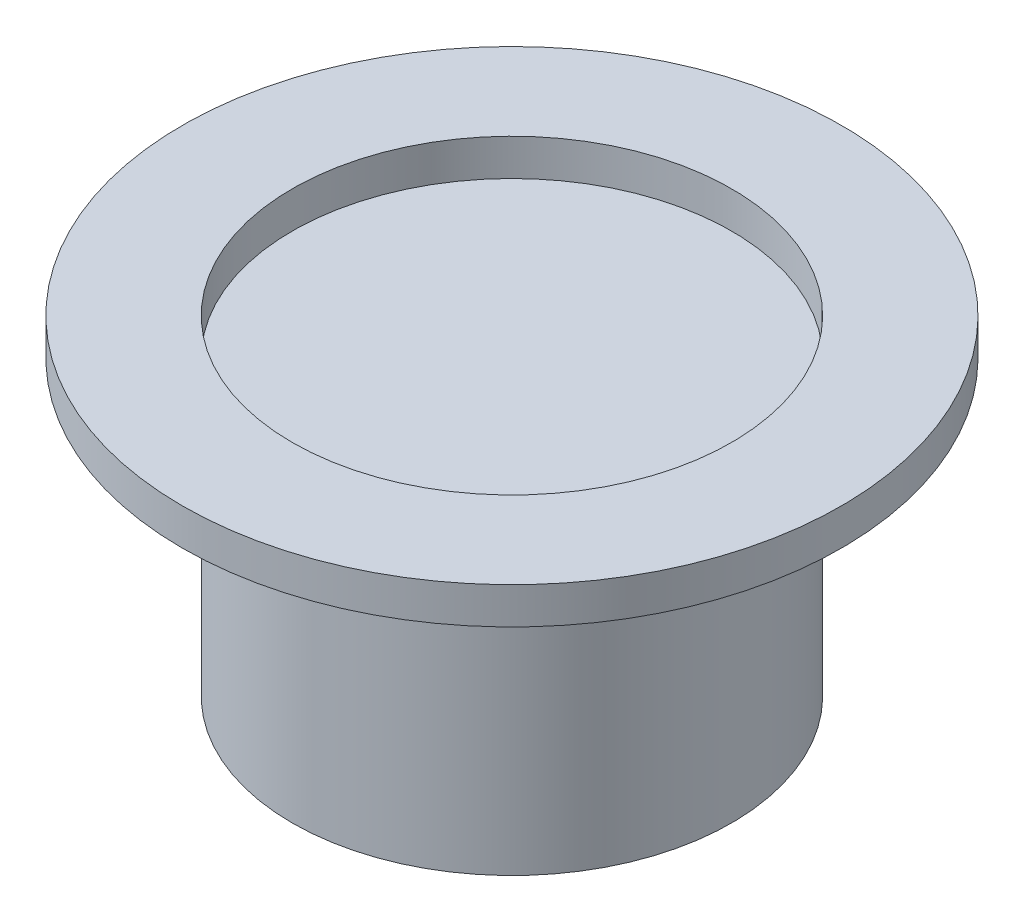
ISO-10303-21;
HEADER;
FILE_DESCRIPTION(('STEP AP214'),'2;1');
FILE_NAME('part.step','',(''),(''),'','','');
FILE_SCHEMA(('AUTOMOTIVE_DESIGN { 1 0 10303 214 1 1 1 1 }'));
ENDSEC;
DATA;
#1=APPLICATION_CONTEXT('core data for automotive mechanical design processes');
#2=APPLICATION_PROTOCOL_DEFINITION('international standard','automotive_design',2000,#1);
#3=PRODUCT_CONTEXT('',#1,'mechanical');
#4=PRODUCT('Part','Part','',(#3));
#5=PRODUCT_RELATED_PRODUCT_CATEGORY('part','',(#4));
#6=PRODUCT_DEFINITION_FORMATION('','',#4);
#7=PRODUCT_DEFINITION_CONTEXT('part definition',#1,'design');
#8=PRODUCT_DEFINITION('design','',#6,#7);
#9=PRODUCT_DEFINITION_SHAPE('','',#8);
#10=(LENGTH_UNIT() NAMED_UNIT(*) SI_UNIT(.MILLI.,.METRE.));
#11=(NAMED_UNIT(*) PLANE_ANGLE_UNIT() SI_UNIT($,.RADIAN.));
#12=(NAMED_UNIT(*) SI_UNIT($,.STERADIAN.) SOLID_ANGLE_UNIT());
#13=UNCERTAINTY_MEASURE_WITH_UNIT(LENGTH_MEASURE(1.E-05),#10,'distance_accuracy_value','');
#14=(GEOMETRIC_REPRESENTATION_CONTEXT(3) GLOBAL_UNCERTAINTY_ASSIGNED_CONTEXT((#13)) GLOBAL_UNIT_ASSIGNED_CONTEXT((#10,
#11,#12)) REPRESENTATION_CONTEXT('',''));
#15=CARTESIAN_POINT('',(0.,0.,0.));
#16=DIRECTION('',(0.,0.,1.));
#17=DIRECTION('',(1.,0.,0.));
#18=AXIS2_PLACEMENT_3D('',#15,#16,#17);
#19=CARTESIAN_POINT('',(0.,4.5,0.));
#20=DIRECTION('',(0.,1.,0.));
#21=DIRECTION('',(0.,0.,1.));
#22=AXIS2_PLACEMENT_3D('',#19,#20,#21);
#23=PLANE('',#22);
#24=CARTESIAN_POINT('',(0.,4.5,0.));
#25=DIRECTION('',(0.,1.,0.));
#26=DIRECTION('',(0.,0.,1.));
#27=AXIS2_PLACEMENT_3D('',#24,#25,#26);
#28=CIRCLE('',#27,4.5);
#29=CARTESIAN_POINT('',(0.,4.5,4.5));
#30=VERTEX_POINT('',#29);
#31=EDGE_CURVE('E11',#30,#30,#28,.T.);
#32=ORIENTED_EDGE('',*,*,#31,.T.);
#33=EDGE_LOOP('',(#32));
#34=FACE_BOUND('',#33,.T.);
#35=CARTESIAN_POINT('',(0.,4.5,0.));
#36=DIRECTION('',(0.,1.,0.));
#37=DIRECTION('',(0.,0.,1.));
#38=AXIS2_PLACEMENT_3D('',#35,#36,#37);
#39=CIRCLE('',#38,3.);
#40=CARTESIAN_POINT('',(0.,4.5,3.));
#41=VERTEX_POINT('',#40);
#42=EDGE_CURVE('E52',#41,#41,#39,.T.);
#43=ORIENTED_EDGE('',*,*,#42,.F.);
#44=EDGE_LOOP('',(#43));
#45=FACE_BOUND('',#44,.T.);
#46=ADVANCED_FACE('F41',(#34,#45),#23,.T.);
#47=CARTESIAN_POINT('',(0.,4.,0.));
#48=DIRECTION('',(0.,1.,0.));
#49=DIRECTION('',(0.,0.,1.));
#50=AXIS2_PLACEMENT_3D('',#47,#48,#49);
#51=PLANE('',#50);
#52=CARTESIAN_POINT('',(0.,4.,0.));
#53=DIRECTION('',(0.,1.,0.));
#54=DIRECTION('',(0.,0.,1.));
#55=AXIS2_PLACEMENT_3D('',#52,#53,#54);
#56=CIRCLE('',#55,4.5);
#57=CARTESIAN_POINT('',(0.,4.,4.5));
#58=VERTEX_POINT('',#57);
#59=EDGE_CURVE('E45',#58,#58,#56,.T.);
#60=ORIENTED_EDGE('',*,*,#59,.F.);
#61=EDGE_LOOP('',(#60));
#62=FACE_BOUND('',#61,.T.);
#63=CARTESIAN_POINT('',(0.,4.,0.));
#64=DIRECTION('',(0.,1.,0.));
#65=DIRECTION('',(0.,0.,1.));
#66=AXIS2_PLACEMENT_3D('',#63,#64,#65);
#67=CIRCLE('',#66,3.);
#68=CARTESIAN_POINT('',(0.,4.,3.));
#69=VERTEX_POINT('',#68);
#70=EDGE_CURVE('E54',#69,#69,#67,.T.);
#71=ORIENTED_EDGE('',*,*,#70,.T.);
#72=EDGE_LOOP('',(#71));
#73=FACE_BOUND('',#72,.T.);
#74=ADVANCED_FACE('F64',(#62,#73),#51,.F.);
#75=CARTESIAN_POINT('',(0.,4.5,0.));
#76=DIRECTION('',(0.,-1.,0.));
#77=DIRECTION('',(0.,0.,-1.));
#78=AXIS2_PLACEMENT_3D('',#75,#76,#77);
#79=CYLINDRICAL_SURFACE('',#78,4.5);
#80=ORIENTED_EDGE('',*,*,#31,.F.);
#81=EDGE_LOOP('',(#80));
#82=FACE_BOUND('',#81,.T.);
#83=ORIENTED_EDGE('',*,*,#59,.T.);
#84=EDGE_LOOP('',(#83));
#85=FACE_BOUND('',#84,.T.);
#86=ADVANCED_FACE('F43',(#82,#85),#79,.T.);
#87=CARTESIAN_POINT('',(0.,4.5,0.));
#88=DIRECTION('',(0.,-1.,0.));
#89=DIRECTION('',(0.,0.,-1.));
#90=AXIS2_PLACEMENT_3D('',#87,#88,#89);
#91=CYLINDRICAL_SURFACE('',#90,3.);
#92=ORIENTED_EDGE('',*,*,#42,.T.);
#93=EDGE_LOOP('',(#92));
#94=FACE_BOUND('',#93,.T.);
#95=ORIENTED_EDGE('',*,*,#70,.F.);
#96=EDGE_LOOP('',(#95));
#97=FACE_BOUND('',#96,.T.);
#98=ADVANCED_FACE('F60',(#94,#97),#91,.F.);
#99=CLOSED_SHELL('',(#46,#74,#86,#98));
#100=MANIFOLD_SOLID_BREP('B2',#99);
#101=CARTESIAN_POINT('',(0.,4.,0.));
#102=DIRECTION('',(0.,-1.,0.));
#103=DIRECTION('',(0.,0.,-1.));
#104=AXIS2_PLACEMENT_3D('',#101,#102,#103);
#105=CYLINDRICAL_SURFACE('',#104,3.);
#106=CARTESIAN_POINT('',(0.,4.,0.));
#107=DIRECTION('',(0.,1.,0.));
#108=DIRECTION('',(0.,0.,1.));
#109=AXIS2_PLACEMENT_3D('',#106,#107,#108);
#110=CIRCLE('',#109,3.);
#111=CARTESIAN_POINT('',(0.,4.,3.));
#112=VERTEX_POINT('',#111);
#113=EDGE_CURVE('E40',#112,#112,#110,.T.);
#114=ORIENTED_EDGE('',*,*,#113,.F.);
#115=EDGE_LOOP('',(#114));
#116=FACE_BOUND('',#115,.T.);
#117=CARTESIAN_POINT('',(0.,0.,0.));
#118=DIRECTION('',(0.,1.,0.));
#119=DIRECTION('',(0.,0.,1.));
#120=AXIS2_PLACEMENT_3D('',#117,#118,#119);
#121=CIRCLE('',#120,3.);
#122=CARTESIAN_POINT('',(0.,0.,3.));
#123=VERTEX_POINT('',#122);
#124=EDGE_CURVE('E106',#123,#123,#121,.T.);
#125=ORIENTED_EDGE('',*,*,#124,.T.);
#126=EDGE_LOOP('',(#125));
#127=FACE_BOUND('',#126,.T.);
#128=ADVANCED_FACE('F103',(#116,#127),#105,.T.);
#129=CARTESIAN_POINT('',(0.,4.,0.));
#130=DIRECTION('',(0.,1.,0.));
#131=DIRECTION('',(0.,0.,1.));
#132=AXIS2_PLACEMENT_3D('',#129,#130,#131);
#133=PLANE('',#132);
#134=ORIENTED_EDGE('',*,*,#113,.T.);
#135=EDGE_LOOP('',(#134));
#136=FACE_BOUND('',#135,.T.);
#137=ADVANCED_FACE('F118',(#136),#133,.T.);
#138=CARTESIAN_POINT('',(0.,0.,0.));
#139=DIRECTION('',(0.,1.,0.));
#140=DIRECTION('',(0.,0.,1.));
#141=AXIS2_PLACEMENT_3D('',#138,#139,#140);
#142=PLANE('',#141);
#143=ORIENTED_EDGE('',*,*,#124,.F.);
#144=EDGE_LOOP('',(#143));
#145=FACE_BOUND('',#144,.T.);
#146=ADVANCED_FACE('F116',(#145),#142,.F.);
#147=CLOSED_SHELL('',(#128,#137,#146));
#148=MANIFOLD_SOLID_BREP('B6',#147);
#149=ADVANCED_BREP_SHAPE_REPRESENTATION('',(#18,#100,#148),#14);
#150=SHAPE_DEFINITION_REPRESENTATION(#9,#149);
ENDSEC;
END-ISO-10303-21;
